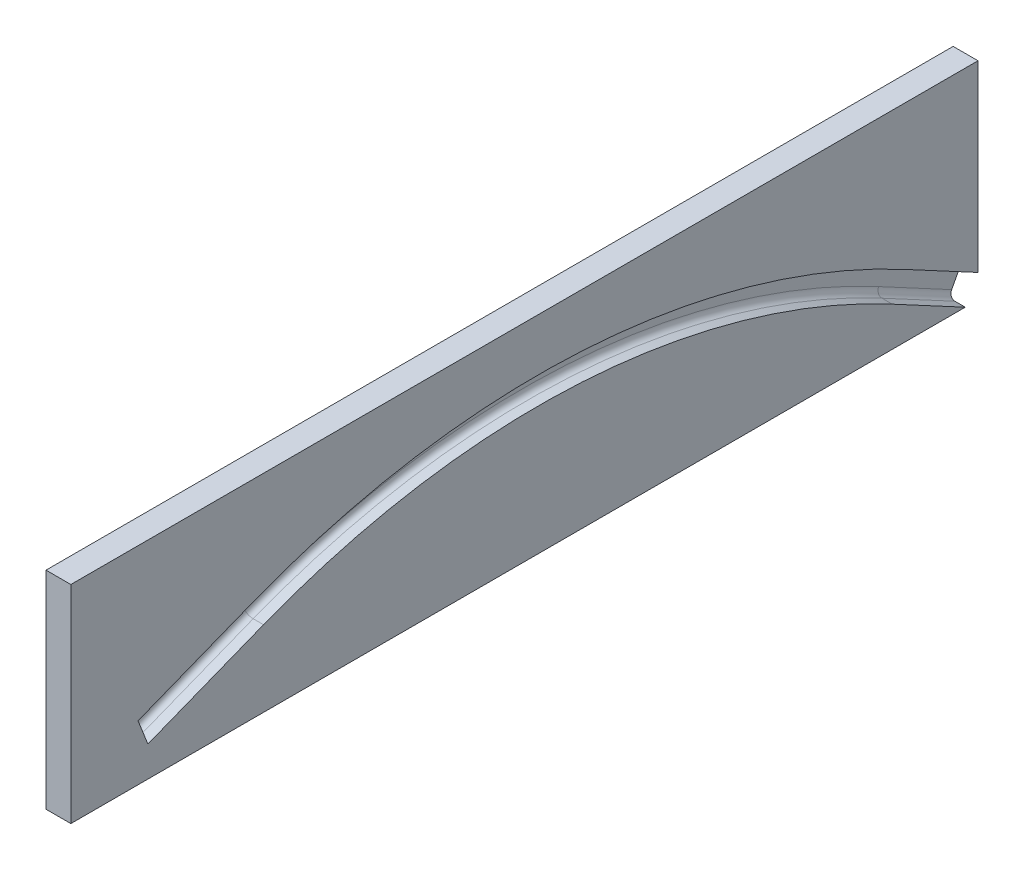
ISO-10303-21;
HEADER;
FILE_DESCRIPTION(('STEP AP214'),'2;1');
FILE_NAME('part.step','',(''),(''),'','','');
FILE_SCHEMA(('AUTOMOTIVE_DESIGN { 1 0 10303 214 1 1 1 1 }'));
ENDSEC;
DATA;
#1=APPLICATION_CONTEXT('core data for automotive mechanical design processes');
#2=APPLICATION_PROTOCOL_DEFINITION('international standard','automotive_design',2000,#1);
#3=PRODUCT_CONTEXT('',#1,'mechanical');
#4=PRODUCT('Part','Part','',(#3));
#5=PRODUCT_RELATED_PRODUCT_CATEGORY('part','',(#4));
#6=PRODUCT_DEFINITION_FORMATION('','',#4);
#7=PRODUCT_DEFINITION_CONTEXT('part definition',#1,'design');
#8=PRODUCT_DEFINITION('design','',#6,#7);
#9=PRODUCT_DEFINITION_SHAPE('','',#8);
#10=(LENGTH_UNIT() NAMED_UNIT(*) SI_UNIT(.MILLI.,.METRE.));
#11=(NAMED_UNIT(*) PLANE_ANGLE_UNIT() SI_UNIT($,.RADIAN.));
#12=(NAMED_UNIT(*) SI_UNIT($,.STERADIAN.) SOLID_ANGLE_UNIT());
#13=UNCERTAINTY_MEASURE_WITH_UNIT(LENGTH_MEASURE(1.E-05),#10,'distance_accuracy_value','');
#14=(GEOMETRIC_REPRESENTATION_CONTEXT(3) GLOBAL_UNCERTAINTY_ASSIGNED_CONTEXT((#13)) GLOBAL_UNIT_ASSIGNED_CONTEXT((#10,
#11,#12)) REPRESENTATION_CONTEXT('',''));
#15=CARTESIAN_POINT('',(0.,0.,0.));
#16=DIRECTION('',(0.,0.,1.));
#17=DIRECTION('',(1.,0.,0.));
#18=AXIS2_PLACEMENT_3D('',#15,#16,#17);
#19=CARTESIAN_POINT('',(3.96516560308933,0.,0.));
#20=DIRECTION('',(-1.,0.,0.));
#21=DIRECTION('',(0.,0.,1.));
#22=AXIS2_PLACEMENT_3D('',#19,#20,#21);
#23=PLANE('',#22);
#24=CARTESIAN_POINT('',(3.96516560308933,0.,0.));
#25=DIRECTION('',(-1.,0.,0.));
#26=DIRECTION('',(0.,0.,1.));
#27=AXIS2_PLACEMENT_3D('',#24,#25,#26);
#28=CIRCLE('',#27,182.429999999999);
#29=CARTESIAN_POINT('',(3.96516560308933,169.732308493519,66.8703847264322));
#30=VERTEX_POINT('',#29);
#31=CARTESIAN_POINT('',(3.96516560308933,160.78104701174,-86.1983748211554));
#32=VERTEX_POINT('',#31);
#33=EDGE_CURVE('E248',#30,#32,#28,.T.);
#34=ORIENTED_EDGE('',*,*,#33,.T.);
#35=DIRECTION('',(0.,0.472501095330577,0.881330082835826));
#36=VECTOR('',#35,1.);
#37=CARTESIAN_POINT('',(3.96516560308933,151.331025105127,-103.824976477871));
#38=LINE('',#37,#36);
#39=CARTESIAN_POINT('',(3.96516560308933,151.331025105127,-103.824976477871));
#40=VERTEX_POINT('',#39);
#41=EDGE_CURVE('E250',#32,#40,#38,.F.);
#42=ORIENTED_EDGE('',*,*,#41,.T.);
#43=DIRECTION('',(0.,-0.881330082835826,0.472501095330579));
#44=VECTOR('',#43,1.);
#45=CARTESIAN_POINT('',(3.96516560308933,-9.4500219066107,-17.6266016567149));
#46=LINE('',#45,#44);
#47=CARTESIAN_POINT('',(3.96516560308933,154.415680395053,-105.478730311528));
#48=VERTEX_POINT('',#47);
#49=EDGE_CURVE('E198',#48,#40,#46,.T.);
#50=ORIENTED_EDGE('',*,*,#49,.F.);
#51=DIRECTION('',(0.,-0.472501095330578,-0.881330082835826));
#52=VECTOR('',#51,1.);
#53=CARTESIAN_POINT('',(3.96516560308933,163.865702301664,-87.8521286548118));
#54=LINE('',#53,#52);
#55=CARTESIAN_POINT('',(3.96516560308933,163.865702301665,-87.8521286548124));
#56=VERTEX_POINT('',#55);
#57=EDGE_CURVE('E244',#48,#56,#54,.F.);
#58=ORIENTED_EDGE('',*,*,#57,.T.);
#59=CARTESIAN_POINT('',(3.96516560308933,0.,0.));
#60=DIRECTION('',(-1.,0.,0.));
#61=DIRECTION('',(0.,0.,1.));
#62=AXIS2_PLACEMENT_3D('',#59,#60,#61);
#63=CIRCLE('',#62,185.929999999999);
#64=CARTESIAN_POINT('',(3.96516560308933,172.988697682397,68.1533225466506));
#65=VERTEX_POINT('',#64);
#66=EDGE_CURVE('E240',#56,#65,#63,.F.);
#67=ORIENTED_EDGE('',*,*,#66,.T.);
#68=DIRECTION('',(0.,0.366553662919653,-0.930396911108472));
#69=VECTOR('',#68,1.);
#70=CARTESIAN_POINT('',(3.96516560308933,161.992087794809,96.0652298799052));
#71=LINE('',#70,#69);
#72=CARTESIAN_POINT('',(3.96516560308933,161.992087794809,96.0652298799052));
#73=VERTEX_POINT('',#72);
#74=EDGE_CURVE('E242',#65,#73,#71,.F.);
#75=ORIENTED_EDGE('',*,*,#74,.T.);
#76=DIRECTION('',(0.,0.930396911108472,0.366553662919652));
#77=VECTOR('',#76,1.);
#78=CARTESIAN_POINT('',(3.96516560308933,-10.9966098875896,27.9119073332543));
#79=LINE('',#78,#77);
#80=CARTESIAN_POINT('',(3.96516560308933,158.735698605929,94.7822920596864));
#81=VERTEX_POINT('',#80);
#82=EDGE_CURVE('E165',#81,#73,#79,.T.);
#83=ORIENTED_EDGE('',*,*,#82,.F.);
#84=DIRECTION('',(0.,-0.366553662919652,0.930396911108472));
#85=VECTOR('',#84,1.);
#86=CARTESIAN_POINT('',(3.96516560308933,169.732308493519,66.8703847264322));
#87=LINE('',#86,#85);
#88=EDGE_CURVE('E246',#81,#30,#87,.F.);
#89=ORIENTED_EDGE('',*,*,#88,.T.);
#90=EDGE_LOOP('',(#34,#42,#50,#58,#67,#75,#83,#89));
#91=FACE_BOUND('',#90,.T.);
#92=ADVANCED_FACE('F35',(#91),#23,.F.);
#93=CARTESIAN_POINT('',(1.96516560308933,0.,-106.187481954524));
#94=DIRECTION('',(0.,0.,1.));
#95=DIRECTION('',(0.,-1.,0.));
#96=AXIS2_PLACEMENT_3D('',#93,#94,#95);
#97=PLANE('',#96);
#98=DIRECTION('',(1.,0.,0.));
#99=VECTOR('',#98,1.);
#100=CARTESIAN_POINT('',(1.96516560308933,200.009029980873,-106.187481954524));
#101=LINE('',#100,#99);
#102=CARTESIAN_POINT('',(1.96516560308933,200.009029980873,-106.187481954524));
#103=VERTEX_POINT('',#102);
#104=CARTESIAN_POINT('',(7.96516560308933,200.009029980873,-106.187481954524));
#105=VERTEX_POINT('',#104);
#106=EDGE_CURVE('E225',#103,#105,#101,.T.);
#107=ORIENTED_EDGE('',*,*,#106,.T.);
#108=DIRECTION('',(0.,-1.,0.));
#109=VECTOR('',#108,1.);
#110=CARTESIAN_POINT('',(7.96516560308933,0.,-106.187481954524));
#111=LINE('',#110,#109);
#112=CARTESIAN_POINT('',(7.96516560308933,155.737675519306,-106.187481954524));
#113=VERTEX_POINT('',#112);
#114=EDGE_CURVE('E184',#105,#113,#111,.T.);
#115=ORIENTED_EDGE('',*,*,#114,.T.);
#116=DIRECTION('',(-1.,0.,0.));
#117=VECTOR('',#116,1.);
#118=CARTESIAN_POINT('',(7.96516560308933,155.737675519306,-106.187481954524));
#119=LINE('',#118,#117);
#120=CARTESIAN_POINT('',(5.46516560308933,155.737675519306,-106.187481954524));
#121=VERTEX_POINT('',#120);
#122=EDGE_CURVE('E208',#113,#121,#119,.T.);
#123=ORIENTED_EDGE('',*,*,#122,.T.);
#124=DIRECTION('',(1.,0.,0.));
#125=VECTOR('',#124,1.);
#126=CARTESIAN_POINT('',(1.96516560308933,155.737675519306,-106.187481954524));
#127=LINE('',#126,#125);
#128=CARTESIAN_POINT('',(1.96516560308933,155.737675519306,-106.187481954524));
#129=VERTEX_POINT('',#128);
#130=EDGE_CURVE('E234',#129,#121,#127,.T.);
#131=ORIENTED_EDGE('',*,*,#130,.F.);
#132=DIRECTION('',(0.,-1.,0.));
#133=VECTOR('',#132,1.);
#134=CARTESIAN_POINT('',(1.96516560308933,0.,-106.187481954524));
#135=LINE('',#134,#133);
#136=EDGE_CURVE('E214',#103,#129,#135,.T.);
#137=ORIENTED_EDGE('',*,*,#136,.F.);
#138=EDGE_LOOP('',(#107,#115,#123,#131,#137));
#139=FACE_BOUND('',#138,.T.);
#140=ADVANCED_FACE('F320',(#139),#97,.F.);
#141=CARTESIAN_POINT('',(1.96516560308933,-9.4500219066107,-17.6266016567149));
#142=DIRECTION('',(0.,0.472501095330578,0.881330082835826));
#143=DIRECTION('',(0.,-0.881330082835826,0.472501095330579));
#144=AXIS2_PLACEMENT_3D('',#141,#142,#143);
#145=PLANE('',#144);
#146=ORIENTED_EDGE('',*,*,#130,.T.);
#147=CARTESIAN_POINT('',(5.46516560308933,154.415680395053,-105.478730311528));
#148=DIRECTION('',(0.,0.472501095330578,0.881330082835826));
#149=DIRECTION('',(0.,-0.881330082835826,0.472501095330579));
#150=AXIS2_PLACEMENT_3D('',#147,#148,#149);
#151=CIRCLE('',#150,1.5);
#152=EDGE_CURVE('E11',#121,#48,#151,.T.);
#153=ORIENTED_EDGE('',*,*,#152,.T.);
#154=ORIENTED_EDGE('',*,*,#49,.T.);
#155=CARTESIAN_POINT('',(5.46516560308933,151.331025105127,-103.824976477871));
#156=DIRECTION('',(0.,0.472501095330578,0.881330082835826));
#157=DIRECTION('',(0.,-0.881330082835826,0.472501095330579));
#158=AXIS2_PLACEMENT_3D('',#155,#156,#157);
#159=CIRCLE('',#158,1.5);
#160=CARTESIAN_POINT('',(5.46516560308933,150.009029980873,-103.116224834875));
#161=VERTEX_POINT('',#160);
#162=EDGE_CURVE('E45',#40,#161,#159,.T.);
#163=ORIENTED_EDGE('',*,*,#162,.T.);
#164=DIRECTION('',(1.,0.,0.));
#165=VECTOR('',#164,1.);
#166=CARTESIAN_POINT('',(1.96516560308933,150.009029980873,-103.116224834875));
#167=LINE('',#166,#165);
#168=CARTESIAN_POINT('',(1.96516560308933,150.009029980873,-103.116224834875));
#169=VERTEX_POINT('',#168);
#170=EDGE_CURVE('E53',#169,#161,#167,.T.);
#171=ORIENTED_EDGE('',*,*,#170,.F.);
#172=DIRECTION('',(0.,-0.881330082835826,0.472501095330579));
#173=VECTOR('',#172,1.);
#174=CARTESIAN_POINT('',(1.96516560308933,-9.4500219066107,-17.6266016567149));
#175=LINE('',#174,#173);
#176=EDGE_CURVE('E217',#129,#169,#175,.T.);
#177=ORIENTED_EDGE('',*,*,#176,.F.);
#178=EDGE_LOOP('',(#146,#153,#154,#163,#171,#177));
#179=FACE_BOUND('',#178,.T.);
#180=ADVANCED_FACE('F310',(#179),#145,.F.);
#181=CARTESIAN_POINT('',(1.96516560308933,150.009029980873,0.));
#182=DIRECTION('',(0.,1.,0.));
#183=DIRECTION('',(0.,0.,1.));
#184=AXIS2_PLACEMENT_3D('',#181,#182,#183);
#185=PLANE('',#184);
#186=ORIENTED_EDGE('',*,*,#170,.T.);
#187=DIRECTION('',(-1.,0.,0.));
#188=VECTOR('',#187,1.);
#189=CARTESIAN_POINT('',(7.96516560308933,150.009029980873,-103.116224834875));
#190=LINE('',#189,#188);
#191=CARTESIAN_POINT('',(7.96516560308933,150.009029980873,-103.116224834875));
#192=VERTEX_POINT('',#191);
#193=EDGE_CURVE('E211',#192,#161,#190,.T.);
#194=ORIENTED_EDGE('',*,*,#193,.F.);
#195=DIRECTION('',(0.,0.,1.));
#196=VECTOR('',#195,1.);
#197=CARTESIAN_POINT('',(7.96516560308933,150.009029980873,0.));
#198=LINE('',#197,#196);
#199=CARTESIAN_POINT('',(7.96516560308933,150.009029980873,112.840399787476));
#200=VERTEX_POINT('',#199);
#201=EDGE_CURVE('E173',#192,#200,#198,.T.);
#202=ORIENTED_EDGE('',*,*,#201,.T.);
#203=DIRECTION('',(1.,0.,0.));
#204=VECTOR('',#203,1.);
#205=CARTESIAN_POINT('',(1.96516560308933,150.009029980873,112.840399787476));
#206=LINE('',#205,#204);
#207=CARTESIAN_POINT('',(1.96516560308933,150.009029980873,112.840399787476));
#208=VERTEX_POINT('',#207);
#209=EDGE_CURVE('E231',#208,#200,#206,.T.);
#210=ORIENTED_EDGE('',*,*,#209,.F.);
#211=DIRECTION('',(0.,0.,1.));
#212=VECTOR('',#211,1.);
#213=CARTESIAN_POINT('',(1.96516560308933,150.009029980873,0.));
#214=LINE('',#213,#212);
#215=EDGE_CURVE('E219',#169,#208,#214,.T.);
#216=ORIENTED_EDGE('',*,*,#215,.F.);
#217=EDGE_LOOP('',(#186,#194,#202,#210,#216));
#218=FACE_BOUND('',#217,.T.);
#219=ADVANCED_FACE('F334',(#218),#185,.F.);
#220=CARTESIAN_POINT('',(1.96516560308933,0.,112.840399787476));
#221=DIRECTION('',(0.,0.,-1.));
#222=DIRECTION('',(-1.,0.,0.));
#223=AXIS2_PLACEMENT_3D('',#220,#221,#222);
#224=PLANE('',#223);
#225=ORIENTED_EDGE('',*,*,#209,.T.);
#226=DIRECTION('',(0.,1.,0.));
#227=VECTOR('',#226,1.);
#228=CARTESIAN_POINT('',(7.96516560308933,0.,112.840399787476));
#229=LINE('',#228,#227);
#230=CARTESIAN_POINT('',(7.96516560308933,200.009029980873,112.840399787476));
#231=VERTEX_POINT('',#230);
#232=EDGE_CURVE('E178',#200,#231,#229,.T.);
#233=ORIENTED_EDGE('',*,*,#232,.T.);
#234=DIRECTION('',(1.,0.,0.));
#235=VECTOR('',#234,1.);
#236=CARTESIAN_POINT('',(1.96516560308933,200.009029980873,112.840399787476));
#237=LINE('',#236,#235);
#238=CARTESIAN_POINT('',(1.96516560308933,200.009029980873,112.840399787476));
#239=VERTEX_POINT('',#238);
#240=EDGE_CURVE('E229',#239,#231,#237,.T.);
#241=ORIENTED_EDGE('',*,*,#240,.F.);
#242=DIRECTION('',(0.,1.,0.));
#243=VECTOR('',#242,1.);
#244=CARTESIAN_POINT('',(1.96516560308933,0.,112.840399787476));
#245=LINE('',#244,#243);
#246=EDGE_CURVE('E221',#208,#239,#245,.T.);
#247=ORIENTED_EDGE('',*,*,#246,.F.);
#248=EDGE_LOOP('',(#225,#233,#241,#247));
#249=FACE_BOUND('',#248,.T.);
#250=ADVANCED_FACE('F332',(#249),#224,.F.);
#251=CARTESIAN_POINT('',(1.96516560308933,200.009029980873,-1.01381900994355E-13));
#252=DIRECTION('',(0.,-1.,0.));
#253=DIRECTION('',(0.,0.,-1.));
#254=AXIS2_PLACEMENT_3D('',#251,#252,#253);
#255=PLANE('',#254);
#256=ORIENTED_EDGE('',*,*,#240,.T.);
#257=DIRECTION('',(0.,0.,-1.));
#258=VECTOR('',#257,1.);
#259=CARTESIAN_POINT('',(7.96516560308933,200.009029980873,-1.01381900994355E-13));
#260=LINE('',#259,#258);
#261=EDGE_CURVE('E181',#231,#105,#260,.T.);
#262=ORIENTED_EDGE('',*,*,#261,.T.);
#263=ORIENTED_EDGE('',*,*,#106,.F.);
#264=DIRECTION('',(0.,0.,-1.));
#265=VECTOR('',#264,1.);
#266=CARTESIAN_POINT('',(1.96516560308933,200.009029980873,-1.01381900994355E-13));
#267=LINE('',#266,#265);
#268=EDGE_CURVE('E223',#239,#103,#267,.T.);
#269=ORIENTED_EDGE('',*,*,#268,.F.);
#270=EDGE_LOOP('',(#256,#262,#263,#269));
#271=FACE_BOUND('',#270,.T.);
#272=ADVANCED_FACE('F327',(#271),#255,.F.);
#273=CARTESIAN_POINT('',(1.96516560308933,0.,0.));
#274=DIRECTION('',(-1.,0.,0.));
#275=DIRECTION('',(0.,0.,1.));
#276=AXIS2_PLACEMENT_3D('',#273,#274,#275);
#277=PLANE('',#276);
#278=ORIENTED_EDGE('',*,*,#136,.T.);
#279=ORIENTED_EDGE('',*,*,#176,.T.);
#280=ORIENTED_EDGE('',*,*,#215,.T.);
#281=ORIENTED_EDGE('',*,*,#246,.T.);
#282=ORIENTED_EDGE('',*,*,#268,.T.);
#283=EDGE_LOOP('',(#278,#279,#280,#281,#282));
#284=FACE_BOUND('',#283,.T.);
#285=ADVANCED_FACE('F336',(#284),#277,.T.);
#286=CARTESIAN_POINT('',(7.96516560308933,168.336713126856,66.3205542320527));
#287=DIRECTION('',(0.,-0.930396911108472,-0.366553662919652));
#288=DIRECTION('',(0.,0.366553662919652,-0.930396911108472));
#289=AXIS2_PLACEMENT_3D('',#286,#287,#288);
#290=PLANE('',#289);
#291=DIRECTION('',(-1.,0.,0.));
#292=VECTOR('',#291,1.);
#293=CARTESIAN_POINT('',(7.96516560308933,168.336713126856,66.3205542320528));
#294=LINE('',#293,#292);
#295=CARTESIAN_POINT('',(7.96516560308933,168.336713126856,66.3205542320528));
#296=VERTEX_POINT('',#295);
#297=CARTESIAN_POINT('',(5.46516560308933,168.336713126856,66.3205542320528));
#298=VERTEX_POINT('',#297);
#299=EDGE_CURVE('E145',#296,#298,#294,.T.);
#300=ORIENTED_EDGE('',*,*,#299,.T.);
#301=DIRECTION('',(0.,-0.366553662919652,0.930396911108472));
#302=VECTOR('',#301,1.);
#303=CARTESIAN_POINT('',(5.46516560308933,157.340103239266,94.2324615653069));
#304=LINE('',#303,#302);
#305=CARTESIAN_POINT('',(5.46516560308933,157.340103239266,94.232461565307));
#306=VERTEX_POINT('',#305);
#307=EDGE_CURVE('E256',#298,#306,#304,.T.);
#308=ORIENTED_EDGE('',*,*,#307,.T.);
#309=DIRECTION('',(-1.,0.,0.));
#310=VECTOR('',#309,1.);
#311=CARTESIAN_POINT('',(7.96516560308933,157.340103239266,94.232461565307));
#312=LINE('',#311,#310);
#313=CARTESIAN_POINT('',(7.96516560308933,157.340103239266,94.232461565307));
#314=VERTEX_POINT('',#313);
#315=EDGE_CURVE('E163',#314,#306,#312,.T.);
#316=ORIENTED_EDGE('',*,*,#315,.F.);
#317=DIRECTION('',(0.,-0.366553662919652,0.930396911108472));
#318=VECTOR('',#317,1.);
#319=CARTESIAN_POINT('',(7.96516560308933,168.336713126856,66.3205542320527));
#320=LINE('',#319,#318);
#321=EDGE_CURVE('E160',#296,#314,#320,.T.);
#322=ORIENTED_EDGE('',*,*,#321,.F.);
#323=EDGE_LOOP('',(#300,#308,#316,#322));
#324=FACE_BOUND('',#323,.T.);
#325=ADVANCED_FACE('F161',(#324),#290,.F.);
#326=CARTESIAN_POINT('',(7.96516560308933,-10.9966098875896,27.9119073332543));
#327=DIRECTION('',(0.,-0.366553662919652,0.930396911108472));
#328=DIRECTION('',(0.,-0.930396911108472,-0.366553662919652));
#329=AXIS2_PLACEMENT_3D('',#326,#327,#328);
#330=PLANE('',#329);
#331=ORIENTED_EDGE('',*,*,#315,.T.);
#332=CARTESIAN_POINT('',(5.46516560308933,158.735698605929,94.7822920596864));
#333=DIRECTION('',(0.,-0.366553662919652,0.930396911108472));
#334=DIRECTION('',(0.,-0.930396911108472,-0.366553662919652));
#335=AXIS2_PLACEMENT_3D('',#332,#333,#334);
#336=CIRCLE('',#335,1.5);
#337=EDGE_CURVE('E260',#306,#81,#336,.F.);
#338=ORIENTED_EDGE('',*,*,#337,.T.);
#339=ORIENTED_EDGE('',*,*,#82,.T.);
#340=CARTESIAN_POINT('',(5.46516560308933,161.992087794809,96.0652298799052));
#341=DIRECTION('',(0.,-0.366553662919652,0.930396911108472));
#342=DIRECTION('',(0.,-0.930396911108472,-0.366553662919652));
#343=AXIS2_PLACEMENT_3D('',#340,#341,#342);
#344=CIRCLE('',#343,1.5);
#345=CARTESIAN_POINT('',(5.46516560308933,163.387683161472,96.6150603742847));
#346=VERTEX_POINT('',#345);
#347=EDGE_CURVE('E258',#73,#346,#344,.F.);
#348=ORIENTED_EDGE('',*,*,#347,.T.);
#349=DIRECTION('',(-1.,0.,0.));
#350=VECTOR('',#349,1.);
#351=CARTESIAN_POINT('',(7.96516560308933,163.387683161472,96.6150603742847));
#352=LINE('',#351,#350);
#353=CARTESIAN_POINT('',(7.96516560308933,163.387683161472,96.6150603742847));
#354=VERTEX_POINT('',#353);
#355=EDGE_CURVE('E199',#354,#346,#352,.T.);
#356=ORIENTED_EDGE('',*,*,#355,.F.);
#357=DIRECTION('',(0.,0.930396911108472,0.366553662919652));
#358=VECTOR('',#357,1.);
#359=CARTESIAN_POINT('',(7.96516560308933,-10.9966098875896,27.9119073332543));
#360=LINE('',#359,#358);
#361=EDGE_CURVE('E156',#314,#354,#360,.T.);
#362=ORIENTED_EDGE('',*,*,#361,.F.);
#363=EDGE_LOOP('',(#331,#338,#339,#348,#356,#362));
#364=FACE_BOUND('',#363,.T.);
#365=ADVANCED_FACE('F291',(#364),#330,.F.);
#366=CARTESIAN_POINT('',(7.96516560308933,174.384293049061,68.7031530410307));
#367=DIRECTION('',(0.,0.930396911108472,0.366553662919653));
#368=DIRECTION('',(0.,-0.366553662919653,0.930396911108472));
#369=AXIS2_PLACEMENT_3D('',#366,#367,#368);
#370=PLANE('',#369);
#371=ORIENTED_EDGE('',*,*,#355,.T.);
#372=DIRECTION('',(0.,0.366553662919653,-0.930396911108472));
#373=VECTOR('',#372,1.);
#374=CARTESIAN_POINT('',(5.46516560308933,174.384293049061,68.7031530410305));
#375=LINE('',#374,#373);
#376=CARTESIAN_POINT('',(5.46516560308933,174.384293049061,68.7031530410305));
#377=VERTEX_POINT('',#376);
#378=EDGE_CURVE('E262',#346,#377,#375,.T.);
#379=ORIENTED_EDGE('',*,*,#378,.T.);
#380=DIRECTION('',(-1.,0.,0.));
#381=VECTOR('',#380,1.);
#382=CARTESIAN_POINT('',(7.96516560308933,174.384293049061,68.7031530410305));
#383=LINE('',#382,#381);
#384=CARTESIAN_POINT('',(7.96516560308933,174.384293049061,68.7031530410305));
#385=VERTEX_POINT('',#384);
#386=EDGE_CURVE('E202',#385,#377,#383,.T.);
#387=ORIENTED_EDGE('',*,*,#386,.F.);
#388=DIRECTION('',(0.,0.366553662919653,-0.930396911108472));
#389=VECTOR('',#388,1.);
#390=CARTESIAN_POINT('',(7.96516560308933,174.384293049061,68.7031530410307));
#391=LINE('',#390,#389);
#392=EDGE_CURVE('E191',#354,#385,#391,.T.);
#393=ORIENTED_EDGE('',*,*,#392,.F.);
#394=EDGE_LOOP('',(#371,#379,#387,#393));
#395=FACE_BOUND('',#394,.T.);
#396=ADVANCED_FACE('F415',(#395),#370,.F.);
#397=CARTESIAN_POINT('',(7.96516560308933,0.,0.));
#398=DIRECTION('',(-1.,0.,0.));
#399=DIRECTION('',(0.,0.,1.));
#400=AXIS2_PLACEMENT_3D('',#397,#398,#399);
#401=CYLINDRICAL_SURFACE('',#400,187.429999999999);
#402=ORIENTED_EDGE('',*,*,#386,.T.);
#403=CARTESIAN_POINT('',(5.46516560308933,0.,0.));
#404=DIRECTION('',(-1.,0.,0.));
#405=DIRECTION('',(0.,0.,1.));
#406=AXIS2_PLACEMENT_3D('',#403,#404,#405);
#407=CIRCLE('',#406,187.429999999999);
#408=CARTESIAN_POINT('',(5.46516560308933,165.187697425918,-88.5608802978077));
#409=VERTEX_POINT('',#408);
#410=EDGE_CURVE('E264',#377,#409,#407,.T.);
#411=ORIENTED_EDGE('',*,*,#410,.T.);
#412=DIRECTION('',(-1.,0.,0.));
#413=VECTOR('',#412,1.);
#414=CARTESIAN_POINT('',(7.96516560308933,165.187697425918,-88.5608802978077));
#415=LINE('',#414,#413);
#416=CARTESIAN_POINT('',(7.96516560308933,165.187697425918,-88.5608802978077));
#417=VERTEX_POINT('',#416);
#418=EDGE_CURVE('E205',#417,#409,#415,.T.);
#419=ORIENTED_EDGE('',*,*,#418,.F.);
#420=CARTESIAN_POINT('',(7.96516560308933,0.,0.));
#421=DIRECTION('',(-1.,0.,0.));
#422=DIRECTION('',(0.,0.,1.));
#423=AXIS2_PLACEMENT_3D('',#420,#421,#422);
#424=CIRCLE('',#423,187.429999999999);
#425=EDGE_CURVE('E189',#385,#417,#424,.T.);
#426=ORIENTED_EDGE('',*,*,#425,.F.);
#427=EDGE_LOOP('',(#402,#411,#419,#426));
#428=FACE_BOUND('',#427,.T.);
#429=ADVANCED_FACE('F408',(#428),#401,.F.);
#430=CARTESIAN_POINT('',(7.96516560308933,165.187697425917,-88.5608802978093));
#431=DIRECTION('',(0.,0.881330082835826,-0.472501095330578));
#432=DIRECTION('',(0.,0.472501095330578,0.881330082835826));
#433=AXIS2_PLACEMENT_3D('',#430,#431,#432);
#434=PLANE('',#433);
#435=ORIENTED_EDGE('',*,*,#418,.T.);
#436=DIRECTION('',(0.,-0.472501095330578,-0.881330082835826));
#437=VECTOR('',#436,1.);
#438=CARTESIAN_POINT('',(5.46516560308933,155.737675519306,-106.187481954524));
#439=LINE('',#438,#437);
#440=EDGE_CURVE('E252',#409,#121,#439,.T.);
#441=ORIENTED_EDGE('',*,*,#440,.T.);
#442=ORIENTED_EDGE('',*,*,#122,.F.);
#443=DIRECTION('',(0.,-0.472501095330578,-0.881330082835826));
#444=VECTOR('',#443,1.);
#445=CARTESIAN_POINT('',(7.96516560308933,165.187697425917,-88.5608802978093));
#446=LINE('',#445,#444);
#447=EDGE_CURVE('E187',#417,#113,#446,.T.);
#448=ORIENTED_EDGE('',*,*,#447,.F.);
#449=EDGE_LOOP('',(#435,#441,#442,#448));
#450=FACE_BOUND('',#449,.T.);
#451=ADVANCED_FACE('F315',(#450),#434,.F.);
#452=CARTESIAN_POINT('',(7.96516560308933,159.459051887484,-85.4896231781603));
#453=DIRECTION('',(0.,-0.881330082835826,0.472501095330577));
#454=DIRECTION('',(0.,-0.472501095330577,-0.881330082835826));
#455=AXIS2_PLACEMENT_3D('',#452,#453,#454);
#456=PLANE('',#455);
#457=ORIENTED_EDGE('',*,*,#193,.T.);
#458=DIRECTION('',(0.,0.472501095330577,0.881330082835826));
#459=VECTOR('',#458,1.);
#460=CARTESIAN_POINT('',(5.46516560308933,159.459051887485,-85.4896231781589));
#461=LINE('',#460,#459);
#462=CARTESIAN_POINT('',(5.46516560308933,159.459051887485,-85.489623178159));
#463=VERTEX_POINT('',#462);
#464=EDGE_CURVE('E237',#161,#463,#461,.T.);
#465=ORIENTED_EDGE('',*,*,#464,.T.);
#466=DIRECTION('',(-1.,0.,0.));
#467=VECTOR('',#466,1.);
#468=CARTESIAN_POINT('',(7.96516560308933,159.459051887485,-85.489623178159));
#469=LINE('',#468,#467);
#470=CARTESIAN_POINT('',(7.96516560308933,159.459051887485,-85.489623178159));
#471=VERTEX_POINT('',#470);
#472=EDGE_CURVE('E155',#471,#463,#469,.T.);
#473=ORIENTED_EDGE('',*,*,#472,.F.);
#474=DIRECTION('',(0.,0.472501095330577,0.881330082835826));
#475=VECTOR('',#474,1.);
#476=CARTESIAN_POINT('',(7.96516560308933,159.459051887484,-85.4896231781603));
#477=LINE('',#476,#475);
#478=EDGE_CURVE('E170',#192,#471,#477,.T.);
#479=ORIENTED_EDGE('',*,*,#478,.F.);
#480=EDGE_LOOP('',(#457,#465,#473,#479));
#481=FACE_BOUND('',#480,.T.);
#482=ADVANCED_FACE('F308',(#481),#456,.F.);
#483=CARTESIAN_POINT('',(7.96516560308933,0.,0.));
#484=DIRECTION('',(-1.,0.,0.));
#485=DIRECTION('',(0.,0.,1.));
#486=AXIS2_PLACEMENT_3D('',#483,#484,#485);
#487=CYLINDRICAL_SURFACE('',#486,180.929999999999);
#488=ORIENTED_EDGE('',*,*,#472,.T.);
#489=CARTESIAN_POINT('',(5.46516560308933,0.,0.));
#490=DIRECTION('',(-1.,0.,0.));
#491=DIRECTION('',(0.,0.,1.));
#492=AXIS2_PLACEMENT_3D('',#489,#490,#491);
#493=CIRCLE('',#492,180.929999999999);
#494=EDGE_CURVE('E152',#463,#298,#493,.F.);
#495=ORIENTED_EDGE('',*,*,#494,.T.);
#496=ORIENTED_EDGE('',*,*,#299,.F.);
#497=CARTESIAN_POINT('',(7.96516560308933,0.,0.));
#498=DIRECTION('',(-1.,0.,0.));
#499=DIRECTION('',(0.,0.,1.));
#500=AXIS2_PLACEMENT_3D('',#497,#498,#499);
#501=CIRCLE('',#500,180.929999999999);
#502=EDGE_CURVE('E150',#296,#471,#501,.T.);
#503=ORIENTED_EDGE('',*,*,#502,.T.);
#504=EDGE_LOOP('',(#488,#495,#496,#503));
#505=FACE_BOUND('',#504,.T.);
#506=ADVANCED_FACE('F148',(#505),#487,.T.);
#507=CARTESIAN_POINT('',(7.96516560308933,0.,0.));
#508=DIRECTION('',(-1.,0.,0.));
#509=DIRECTION('',(0.,0.,1.));
#510=AXIS2_PLACEMENT_3D('',#507,#508,#509);
#511=PLANE('',#510);
#512=ORIENTED_EDGE('',*,*,#321,.T.);
#513=ORIENTED_EDGE('',*,*,#361,.T.);
#514=ORIENTED_EDGE('',*,*,#392,.T.);
#515=ORIENTED_EDGE('',*,*,#425,.T.);
#516=ORIENTED_EDGE('',*,*,#447,.T.);
#517=ORIENTED_EDGE('',*,*,#114,.F.);
#518=ORIENTED_EDGE('',*,*,#261,.F.);
#519=ORIENTED_EDGE('',*,*,#232,.F.);
#520=ORIENTED_EDGE('',*,*,#201,.F.);
#521=ORIENTED_EDGE('',*,*,#478,.T.);
#522=ORIENTED_EDGE('',*,*,#502,.F.);
#523=EDGE_LOOP('',(#512,#513,#514,#515,#516,#517,#518,#519,#520,#521,#522));
#524=FACE_BOUND('',#523,.T.);
#525=ADVANCED_FACE('F167',(#524),#511,.F.);
#526=CARTESIAN_POINT('',(5.46516560308933,169.732308493519,66.8703847264322));
#527=DIRECTION('',(0.,0.366553662919652,-0.930396911108472));
#528=DIRECTION('',(0.,0.930396911108472,0.366553662919652));
#529=AXIS2_PLACEMENT_3D('',#526,#527,#528);
#530=CYLINDRICAL_SURFACE('',#529,1.5);
#531=ORIENTED_EDGE('',*,*,#337,.F.);
#532=ORIENTED_EDGE('',*,*,#307,.F.);
#533=CARTESIAN_POINT('',(5.46516560308933,169.732308493519,66.8703847264322));
#534=DIRECTION('',(0.,-0.366553662919657,0.93039691110847));
#535=DIRECTION('',(0.,-0.93039691110847,-0.366553662919657));
#536=AXIS2_PLACEMENT_3D('',#533,#534,#535);
#537=CIRCLE('',#536,1.5);
#538=EDGE_CURVE('E196',#30,#298,#537,.T.);
#539=ORIENTED_EDGE('',*,*,#538,.F.);
#540=ORIENTED_EDGE('',*,*,#88,.F.);
#541=EDGE_LOOP('',(#531,#532,#539,#540));
#542=FACE_BOUND('',#541,.T.);
#543=ADVANCED_FACE('F295',(#542),#530,.F.);
#544=CARTESIAN_POINT('',(5.46516560308933,0.,0.));
#545=DIRECTION('',(-1.,0.,0.));
#546=DIRECTION('',(0.,0.,1.));
#547=AXIS2_PLACEMENT_3D('',#544,#545,#546);
#548=TOROIDAL_SURFACE('',#547,182.429999999999,1.5);
#549=ORIENTED_EDGE('',*,*,#538,.T.);
#550=ORIENTED_EDGE('',*,*,#494,.F.);
#551=CARTESIAN_POINT('',(5.46516560308933,160.78104701174,-86.1983748211554));
#552=DIRECTION('',(0.,0.472501095330581,0.881330082835824));
#553=DIRECTION('',(0.,-0.881330082835824,0.472501095330581));
#554=AXIS2_PLACEMENT_3D('',#551,#552,#553);
#555=CIRCLE('',#554,1.5);
#556=EDGE_CURVE('E268',#32,#463,#555,.T.);
#557=ORIENTED_EDGE('',*,*,#556,.F.);
#558=ORIENTED_EDGE('',*,*,#33,.F.);
#559=EDGE_LOOP('',(#549,#550,#557,#558));
#560=FACE_BOUND('',#559,.T.);
#561=ADVANCED_FACE('F306',(#560),#548,.F.);
#562=CARTESIAN_POINT('',(5.46516560308933,160.781047011738,-86.1983748211562));
#563=DIRECTION('',(0.,-0.472501095330577,-0.881330082835826));
#564=DIRECTION('',(0.,0.881330082835826,-0.472501095330577));
#565=AXIS2_PLACEMENT_3D('',#562,#563,#564);
#566=CYLINDRICAL_SURFACE('',#565,1.5);
#567=ORIENTED_EDGE('',*,*,#162,.F.);
#568=ORIENTED_EDGE('',*,*,#41,.F.);
#569=ORIENTED_EDGE('',*,*,#556,.T.);
#570=ORIENTED_EDGE('',*,*,#464,.F.);
#571=EDGE_LOOP('',(#567,#568,#569,#570));
#572=FACE_BOUND('',#571,.T.);
#573=ADVANCED_FACE('F304',(#572),#566,.F.);
#574=CARTESIAN_POINT('',(5.46516560308933,172.988697682398,68.1533225466512));
#575=DIRECTION('',(0.,-0.366553662919653,0.930396911108472));
#576=DIRECTION('',(0.,-0.930396911108472,-0.366553662919653));
#577=AXIS2_PLACEMENT_3D('',#574,#575,#576);
#578=CYLINDRICAL_SURFACE('',#577,1.5);
#579=ORIENTED_EDGE('',*,*,#347,.F.);
#580=ORIENTED_EDGE('',*,*,#74,.F.);
#581=CARTESIAN_POINT('',(5.46516560308933,172.988697682398,68.153322546651));
#582=DIRECTION('',(0.,-0.366553662919657,0.93039691110847));
#583=DIRECTION('',(0.,-0.93039691110847,-0.366553662919657));
#584=AXIS2_PLACEMENT_3D('',#581,#582,#583);
#585=CIRCLE('',#584,1.5);
#586=EDGE_CURVE('E39',#377,#65,#585,.T.);
#587=ORIENTED_EDGE('',*,*,#586,.F.);
#588=ORIENTED_EDGE('',*,*,#378,.F.);
#589=EDGE_LOOP('',(#579,#580,#587,#588));
#590=FACE_BOUND('',#589,.T.);
#591=ADVANCED_FACE('F37',(#590),#578,.F.);
#592=CARTESIAN_POINT('',(5.46516560308933,0.,0.));
#593=DIRECTION('',(-1.,0.,0.));
#594=DIRECTION('',(0.,0.,1.));
#595=AXIS2_PLACEMENT_3D('',#592,#593,#594);
#596=TOROIDAL_SURFACE('',#595,185.929999999999,1.5);
#597=ORIENTED_EDGE('',*,*,#586,.T.);
#598=ORIENTED_EDGE('',*,*,#66,.F.);
#599=CARTESIAN_POINT('',(5.46516560308933,163.865702301665,-87.8521286548124));
#600=DIRECTION('',(0.,0.472501095330574,0.881330082835828));
#601=DIRECTION('',(0.,-0.881330082835828,0.472501095330574));
#602=AXIS2_PLACEMENT_3D('',#599,#600,#601);
#603=CIRCLE('',#602,1.5);
#604=EDGE_CURVE('E271',#409,#56,#603,.T.);
#605=ORIENTED_EDGE('',*,*,#604,.F.);
#606=ORIENTED_EDGE('',*,*,#410,.F.);
#607=EDGE_LOOP('',(#597,#598,#605,#606));
#608=FACE_BOUND('',#607,.T.);
#609=ADVANCED_FACE('F282',(#608),#596,.F.);
#610=CARTESIAN_POINT('',(5.46516560308933,163.865702301663,-87.8521286548134));
#611=DIRECTION('',(0.,0.472501095330578,0.881330082835826));
#612=DIRECTION('',(0.,-0.881330082835826,0.472501095330578));
#613=AXIS2_PLACEMENT_3D('',#610,#611,#612);
#614=CYLINDRICAL_SURFACE('',#613,1.5);
#615=ORIENTED_EDGE('',*,*,#604,.T.);
#616=ORIENTED_EDGE('',*,*,#57,.F.);
#617=ORIENTED_EDGE('',*,*,#152,.F.);
#618=ORIENTED_EDGE('',*,*,#440,.F.);
#619=EDGE_LOOP('',(#615,#616,#617,#618));
#620=FACE_BOUND('',#619,.T.);
#621=ADVANCED_FACE('F312',(#620),#614,.F.);
#622=CLOSED_SHELL('',(#92,#140,#180,#219,#250,#272,#285,#325,#365,#396,#429,#451,#482,#506,#525,
#543,#561,#573,#591,#609,#621));
#623=MANIFOLD_SOLID_BREP('B2',#622);
#624=ADVANCED_BREP_SHAPE_REPRESENTATION('',(#18,#623),#14);
#625=SHAPE_DEFINITION_REPRESENTATION(#9,#624);
ENDSEC;
END-ISO-10303-21;
